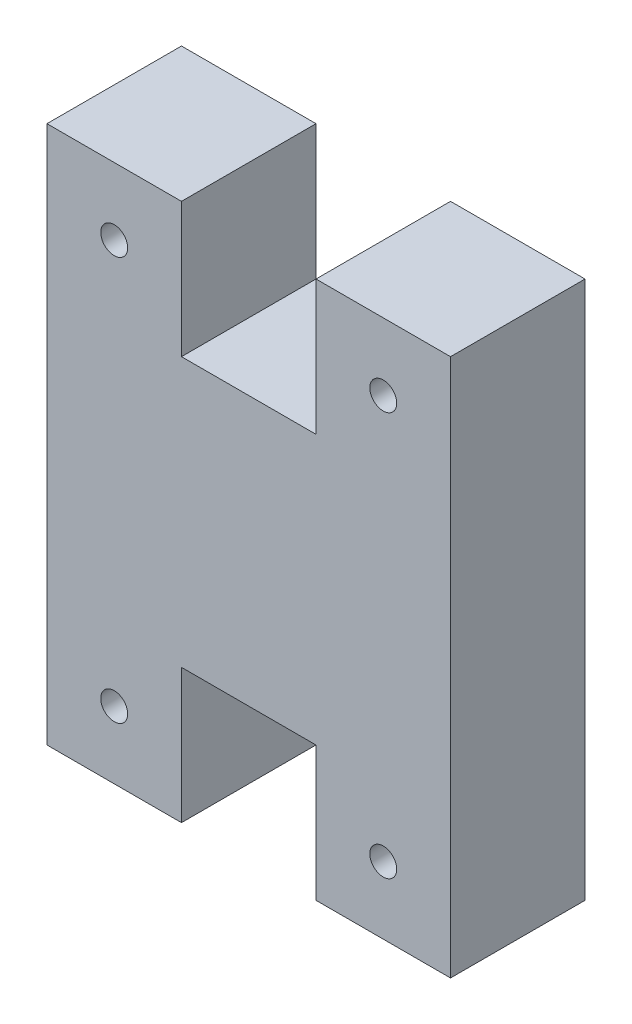
ISO-10303-21;
HEADER;
FILE_DESCRIPTION(('STEP AP214'),'2;1');
FILE_NAME('part.step','',(''),(''),'','','');
FILE_SCHEMA(('AUTOMOTIVE_DESIGN { 1 0 10303 214 1 1 1 1 }'));
ENDSEC;
DATA;
#1=APPLICATION_CONTEXT('core data for automotive mechanical design processes');
#2=APPLICATION_PROTOCOL_DEFINITION('international standard','automotive_design',2000,#1);
#3=PRODUCT_CONTEXT('',#1,'mechanical');
#4=PRODUCT('Part','Part','',(#3));
#5=PRODUCT_RELATED_PRODUCT_CATEGORY('part','',(#4));
#6=PRODUCT_DEFINITION_FORMATION('','',#4);
#7=PRODUCT_DEFINITION_CONTEXT('part definition',#1,'design');
#8=PRODUCT_DEFINITION('design','',#6,#7);
#9=PRODUCT_DEFINITION_SHAPE('','',#8);
#10=(LENGTH_UNIT() NAMED_UNIT(*) SI_UNIT(.MILLI.,.METRE.));
#11=(NAMED_UNIT(*) PLANE_ANGLE_UNIT() SI_UNIT($,.RADIAN.));
#12=(NAMED_UNIT(*) SI_UNIT($,.STERADIAN.) SOLID_ANGLE_UNIT());
#13=UNCERTAINTY_MEASURE_WITH_UNIT(LENGTH_MEASURE(1.E-05),#10,'distance_accuracy_value','');
#14=(GEOMETRIC_REPRESENTATION_CONTEXT(3) GLOBAL_UNCERTAINTY_ASSIGNED_CONTEXT((#13)) GLOBAL_UNIT_ASSIGNED_CONTEXT((#10,
#11,#12)) REPRESENTATION_CONTEXT('',''));
#15=CARTESIAN_POINT('',(0.,0.,0.));
#16=DIRECTION('',(0.,0.,1.));
#17=DIRECTION('',(1.,0.,0.));
#18=AXIS2_PLACEMENT_3D('',#15,#16,#17);
#19=CARTESIAN_POINT('',(0.,0.,6.35));
#20=DIRECTION('',(0.,1.,0.));
#21=DIRECTION('',(0.,0.,1.));
#22=AXIS2_PLACEMENT_3D('',#19,#20,#21);
#23=PLANE('',#22);
#24=DIRECTION('',(0.,0.,1.));
#25=VECTOR('',#24,1.);
#26=CARTESIAN_POINT('',(6.34999999999999,0.,0.));
#27=LINE('',#26,#25);
#28=CARTESIAN_POINT('',(6.34999999999999,0.,0.));
#29=VERTEX_POINT('',#28);
#30=CARTESIAN_POINT('',(6.34999999999999,0.,6.35));
#31=VERTEX_POINT('',#30);
#32=EDGE_CURVE('E232',#29,#31,#27,.T.);
#33=ORIENTED_EDGE('',*,*,#32,.T.);
#34=DIRECTION('',(1.,0.,0.));
#35=VECTOR('',#34,1.);
#36=CARTESIAN_POINT('',(0.,0.,6.35));
#37=LINE('',#36,#35);
#38=CARTESIAN_POINT('',(0.,0.,6.35));
#39=VERTEX_POINT('',#38);
#40=EDGE_CURVE('E189',#39,#31,#37,.T.);
#41=ORIENTED_EDGE('',*,*,#40,.F.);
#42=DIRECTION('',(0.,0.,-1.));
#43=VECTOR('',#42,1.);
#44=CARTESIAN_POINT('',(0.,0.,6.35));
#45=LINE('',#44,#43);
#46=CARTESIAN_POINT('',(0.,0.,0.));
#47=VERTEX_POINT('',#46);
#48=EDGE_CURVE('E13',#39,#47,#45,.T.);
#49=ORIENTED_EDGE('',*,*,#48,.T.);
#50=DIRECTION('',(1.,0.,0.));
#51=VECTOR('',#50,1.);
#52=CARTESIAN_POINT('',(0.,0.,0.));
#53=LINE('',#52,#51);
#54=EDGE_CURVE('E159',#47,#29,#53,.T.);
#55=ORIENTED_EDGE('',*,*,#54,.T.);
#56=EDGE_LOOP('',(#33,#41,#49,#55));
#57=FACE_BOUND('',#56,.T.);
#58=ADVANCED_FACE('F48',(#57),#23,.F.);
#59=DIRECTION('',(0.,0.,1.));
#60=VECTOR('',#59,1.);
#61=CARTESIAN_POINT('',(12.7,0.,0.));
#62=LINE('',#61,#60);
#63=CARTESIAN_POINT('',(12.7,0.,0.));
#64=VERTEX_POINT('',#63);
#65=CARTESIAN_POINT('',(12.7,0.,6.35));
#66=VERTEX_POINT('',#65);
#67=EDGE_CURVE('E138',#64,#66,#62,.T.);
#68=ORIENTED_EDGE('',*,*,#67,.F.);
#69=CARTESIAN_POINT('',(19.05,0.,0.));
#70=VERTEX_POINT('',#69);
#71=EDGE_CURVE('E150',#64,#70,#53,.T.);
#72=ORIENTED_EDGE('',*,*,#71,.T.);
#73=DIRECTION('',(0.,0.,-1.));
#74=VECTOR('',#73,1.);
#75=CARTESIAN_POINT('',(19.05,0.,6.35));
#76=LINE('',#75,#74);
#77=CARTESIAN_POINT('',(19.05,0.,6.35));
#78=VERTEX_POINT('',#77);
#79=EDGE_CURVE('E56',#78,#70,#76,.T.);
#80=ORIENTED_EDGE('',*,*,#79,.F.);
#81=EDGE_CURVE('E152',#66,#78,#37,.T.);
#82=ORIENTED_EDGE('',*,*,#81,.F.);
#83=EDGE_LOOP('',(#68,#72,#80,#82));
#84=FACE_BOUND('',#83,.T.);
#85=ADVANCED_FACE('F148',(#84),#23,.F.);
#86=CARTESIAN_POINT('',(0.,0.,6.35));
#87=DIRECTION('',(0.,0.,-1.));
#88=DIRECTION('',(-1.,0.,0.));
#89=AXIS2_PLACEMENT_3D('',#86,#87,#88);
#90=PLANE('',#89);
#91=CARTESIAN_POINT('',(3.17499999999997,3.17499999999999,6.35));
#92=DIRECTION('',(0.,0.,-1.));
#93=DIRECTION('',(-1.,0.,0.));
#94=AXIS2_PLACEMENT_3D('',#91,#92,#93);
#95=CIRCLE('',#94,0.635);
#96=CARTESIAN_POINT('',(2.53999999999997,3.17499999999999,6.35));
#97=VERTEX_POINT('',#96);
#98=EDGE_CURVE('E284',#97,#97,#95,.T.);
#99=ORIENTED_EDGE('',*,*,#98,.T.);
#100=EDGE_LOOP('',(#99));
#101=FACE_BOUND('',#100,.T.);
#102=CARTESIAN_POINT('',(15.875,3.17499999999999,6.35));
#103=DIRECTION('',(0.,0.,-1.));
#104=DIRECTION('',(-1.,0.,0.));
#105=AXIS2_PLACEMENT_3D('',#102,#103,#104);
#106=CIRCLE('',#105,0.635000000000001);
#107=CARTESIAN_POINT('',(15.24,3.17499999999999,6.35));
#108=VERTEX_POINT('',#107);
#109=EDGE_CURVE('E288',#108,#108,#106,.T.);
#110=ORIENTED_EDGE('',*,*,#109,.T.);
#111=EDGE_LOOP('',(#110));
#112=FACE_BOUND('',#111,.T.);
#113=CARTESIAN_POINT('',(15.875,22.225,6.35));
#114=DIRECTION('',(0.,0.,1.));
#115=DIRECTION('',(1.,0.,0.));
#116=AXIS2_PLACEMENT_3D('',#113,#114,#115);
#117=CIRCLE('',#116,0.634999999999999);
#118=CARTESIAN_POINT('',(16.51,22.225,6.35));
#119=VERTEX_POINT('',#118);
#120=EDGE_CURVE('E292',#119,#119,#117,.T.);
#121=ORIENTED_EDGE('',*,*,#120,.F.);
#122=EDGE_LOOP('',(#121));
#123=FACE_BOUND('',#122,.T.);
#124=CARTESIAN_POINT('',(3.17499999999999,22.225,6.35));
#125=DIRECTION('',(0.,0.,1.));
#126=DIRECTION('',(1.,0.,0.));
#127=AXIS2_PLACEMENT_3D('',#124,#125,#126);
#128=CIRCLE('',#127,0.635);
#129=CARTESIAN_POINT('',(3.80999999999998,22.225,6.35));
#130=VERTEX_POINT('',#129);
#131=EDGE_CURVE('E226',#130,#130,#128,.T.);
#132=ORIENTED_EDGE('',*,*,#131,.F.);
#133=EDGE_LOOP('',(#132));
#134=FACE_BOUND('',#133,.T.);
#135=DIRECTION('',(0.,1.,0.));
#136=VECTOR('',#135,1.);
#137=CARTESIAN_POINT('',(6.34999999999999,0.,6.35));
#138=LINE('',#137,#136);
#139=CARTESIAN_POINT('',(6.35,6.35,6.35));
#140=VERTEX_POINT('',#139);
#141=EDGE_CURVE('E144',#31,#140,#138,.T.);
#142=ORIENTED_EDGE('',*,*,#141,.T.);
#143=DIRECTION('',(1.,0.,0.));
#144=VECTOR('',#143,1.);
#145=CARTESIAN_POINT('',(6.35,6.35,6.35));
#146=LINE('',#145,#144);
#147=CARTESIAN_POINT('',(12.7,6.35,6.35));
#148=VERTEX_POINT('',#147);
#149=EDGE_CURVE('E221',#140,#148,#146,.T.);
#150=ORIENTED_EDGE('',*,*,#149,.T.);
#151=DIRECTION('',(0.,-1.,0.));
#152=VECTOR('',#151,1.);
#153=CARTESIAN_POINT('',(12.7,0.,6.35));
#154=LINE('',#153,#152);
#155=EDGE_CURVE('E219',#148,#66,#154,.T.);
#156=ORIENTED_EDGE('',*,*,#155,.T.);
#157=ORIENTED_EDGE('',*,*,#81,.T.);
#158=DIRECTION('',(0.,1.,0.));
#159=VECTOR('',#158,1.);
#160=CARTESIAN_POINT('',(19.05,0.,6.35));
#161=LINE('',#160,#159);
#162=CARTESIAN_POINT('',(19.05,25.4,6.35));
#163=VERTEX_POINT('',#162);
#164=EDGE_CURVE('E184',#78,#163,#161,.T.);
#165=ORIENTED_EDGE('',*,*,#164,.T.);
#166=DIRECTION('',(-1.,0.,0.));
#167=VECTOR('',#166,1.);
#168=CARTESIAN_POINT('',(0.,25.4,6.35));
#169=LINE('',#168,#167);
#170=CARTESIAN_POINT('',(12.7,25.4,6.35));
#171=VERTEX_POINT('',#170);
#172=EDGE_CURVE('E178',#163,#171,#169,.T.);
#173=ORIENTED_EDGE('',*,*,#172,.T.);
#174=DIRECTION('',(0.,1.,0.));
#175=VECTOR('',#174,1.);
#176=CARTESIAN_POINT('',(12.7,25.4,6.35));
#177=LINE('',#176,#175);
#178=CARTESIAN_POINT('',(12.7,19.05,6.35));
#179=VERTEX_POINT('',#178);
#180=EDGE_CURVE('E198',#179,#171,#177,.T.);
#181=ORIENTED_EDGE('',*,*,#180,.F.);
#182=DIRECTION('',(1.,0.,0.));
#183=VECTOR('',#182,1.);
#184=CARTESIAN_POINT('',(6.35,19.05,6.35));
#185=LINE('',#184,#183);
#186=CARTESIAN_POINT('',(6.35,19.05,6.35));
#187=VERTEX_POINT('',#186);
#188=EDGE_CURVE('E245',#187,#179,#185,.T.);
#189=ORIENTED_EDGE('',*,*,#188,.F.);
#190=DIRECTION('',(0.,-1.,0.));
#191=VECTOR('',#190,1.);
#192=CARTESIAN_POINT('',(6.34999999999999,25.4,6.35));
#193=LINE('',#192,#191);
#194=CARTESIAN_POINT('',(6.34999999999999,25.4,6.35));
#195=VERTEX_POINT('',#194);
#196=EDGE_CURVE('E235',#195,#187,#193,.T.);
#197=ORIENTED_EDGE('',*,*,#196,.F.);
#198=CARTESIAN_POINT('',(0.,25.4,6.35));
#199=VERTEX_POINT('',#198);
#200=EDGE_CURVE('E188',#195,#199,#169,.T.);
#201=ORIENTED_EDGE('',*,*,#200,.T.);
#202=DIRECTION('',(0.,-1.,0.));
#203=VECTOR('',#202,1.);
#204=CARTESIAN_POINT('',(0.,0.,6.35));
#205=LINE('',#204,#203);
#206=EDGE_CURVE('E173',#199,#39,#205,.T.);
#207=ORIENTED_EDGE('',*,*,#206,.T.);
#208=ORIENTED_EDGE('',*,*,#40,.T.);
#209=EDGE_LOOP('',(#142,#150,#156,#157,#165,#173,#181,#189,#197,#201,#207,#208));
#210=FACE_BOUND('',#209,.T.);
#211=ADVANCED_FACE('F196',(#101,#112,#123,#134,#210),#90,.F.);
#212=CARTESIAN_POINT('',(0.,0.,0.));
#213=DIRECTION('',(0.,0.,-1.));
#214=DIRECTION('',(-1.,0.,0.));
#215=AXIS2_PLACEMENT_3D('',#212,#213,#214);
#216=PLANE('',#215);
#217=CARTESIAN_POINT('',(3.17499999999997,3.17499999999999,0.));
#218=DIRECTION('',(0.,0.,-1.));
#219=DIRECTION('',(-1.,0.,0.));
#220=AXIS2_PLACEMENT_3D('',#217,#218,#219);
#221=CIRCLE('',#220,0.635);
#222=CARTESIAN_POINT('',(2.53999999999997,3.17499999999999,0.));
#223=VERTEX_POINT('',#222);
#224=EDGE_CURVE('E431',#223,#223,#221,.T.);
#225=ORIENTED_EDGE('',*,*,#224,.F.);
#226=EDGE_LOOP('',(#225));
#227=FACE_BOUND('',#226,.T.);
#228=CARTESIAN_POINT('',(15.875,3.17499999999999,0.));
#229=DIRECTION('',(0.,0.,-1.));
#230=DIRECTION('',(-1.,0.,0.));
#231=AXIS2_PLACEMENT_3D('',#228,#229,#230);
#232=CIRCLE('',#231,0.635000000000001);
#233=CARTESIAN_POINT('',(15.24,3.17499999999999,0.));
#234=VERTEX_POINT('',#233);
#235=EDGE_CURVE('E433',#234,#234,#232,.T.);
#236=ORIENTED_EDGE('',*,*,#235,.F.);
#237=EDGE_LOOP('',(#236));
#238=FACE_BOUND('',#237,.T.);
#239=CARTESIAN_POINT('',(15.875,22.225,0.));
#240=DIRECTION('',(0.,0.,1.));
#241=DIRECTION('',(1.,0.,0.));
#242=AXIS2_PLACEMENT_3D('',#239,#240,#241);
#243=CIRCLE('',#242,0.634999999999999);
#244=CARTESIAN_POINT('',(16.51,22.225,0.));
#245=VERTEX_POINT('',#244);
#246=EDGE_CURVE('E296',#245,#245,#243,.T.);
#247=ORIENTED_EDGE('',*,*,#246,.T.);
#248=EDGE_LOOP('',(#247));
#249=FACE_BOUND('',#248,.T.);
#250=CARTESIAN_POINT('',(3.17499999999999,22.225,0.));
#251=DIRECTION('',(0.,0.,1.));
#252=DIRECTION('',(1.,0.,0.));
#253=AXIS2_PLACEMENT_3D('',#250,#251,#252);
#254=CIRCLE('',#253,0.635);
#255=CARTESIAN_POINT('',(3.80999999999998,22.225,0.));
#256=VERTEX_POINT('',#255);
#257=EDGE_CURVE('E222',#256,#256,#254,.T.);
#258=ORIENTED_EDGE('',*,*,#257,.T.);
#259=EDGE_LOOP('',(#258));
#260=FACE_BOUND('',#259,.T.);
#261=DIRECTION('',(1.,0.,0.));
#262=VECTOR('',#261,1.);
#263=CARTESIAN_POINT('',(6.35,6.35,0.));
#264=LINE('',#263,#262);
#265=CARTESIAN_POINT('',(6.35,6.35,0.));
#266=VERTEX_POINT('',#265);
#267=CARTESIAN_POINT('',(12.7,6.35,0.));
#268=VERTEX_POINT('',#267);
#269=EDGE_CURVE('E143',#266,#268,#264,.T.);
#270=ORIENTED_EDGE('',*,*,#269,.F.);
#271=DIRECTION('',(0.,1.,0.));
#272=VECTOR('',#271,1.);
#273=CARTESIAN_POINT('',(6.34999999999999,0.,0.));
#274=LINE('',#273,#272);
#275=EDGE_CURVE('E153',#29,#266,#274,.T.);
#276=ORIENTED_EDGE('',*,*,#275,.F.);
#277=ORIENTED_EDGE('',*,*,#54,.F.);
#278=DIRECTION('',(0.,-1.,0.));
#279=VECTOR('',#278,1.);
#280=CARTESIAN_POINT('',(0.,0.,0.));
#281=LINE('',#280,#279);
#282=CARTESIAN_POINT('',(0.,25.4,0.));
#283=VERTEX_POINT('',#282);
#284=EDGE_CURVE('E160',#283,#47,#281,.T.);
#285=ORIENTED_EDGE('',*,*,#284,.F.);
#286=DIRECTION('',(-1.,0.,0.));
#287=VECTOR('',#286,1.);
#288=CARTESIAN_POINT('',(0.,25.4,0.));
#289=LINE('',#288,#287);
#290=CARTESIAN_POINT('',(6.34999999999999,25.4,0.));
#291=VERTEX_POINT('',#290);
#292=EDGE_CURVE('E169',#291,#283,#289,.T.);
#293=ORIENTED_EDGE('',*,*,#292,.F.);
#294=DIRECTION('',(0.,-1.,0.));
#295=VECTOR('',#294,1.);
#296=CARTESIAN_POINT('',(6.34999999999999,25.4,0.));
#297=LINE('',#296,#295);
#298=CARTESIAN_POINT('',(6.35,19.05,0.));
#299=VERTEX_POINT('',#298);
#300=EDGE_CURVE('E239',#291,#299,#297,.T.);
#301=ORIENTED_EDGE('',*,*,#300,.T.);
#302=DIRECTION('',(1.,0.,0.));
#303=VECTOR('',#302,1.);
#304=CARTESIAN_POINT('',(6.35,19.05,0.));
#305=LINE('',#304,#303);
#306=CARTESIAN_POINT('',(12.7,19.05,0.));
#307=VERTEX_POINT('',#306);
#308=EDGE_CURVE('E71',#299,#307,#305,.T.);
#309=ORIENTED_EDGE('',*,*,#308,.T.);
#310=DIRECTION('',(0.,1.,0.));
#311=VECTOR('',#310,1.);
#312=CARTESIAN_POINT('',(12.7,25.4,0.));
#313=LINE('',#312,#311);
#314=CARTESIAN_POINT('',(12.7,25.4,0.));
#315=VERTEX_POINT('',#314);
#316=EDGE_CURVE('E214',#307,#315,#313,.T.);
#317=ORIENTED_EDGE('',*,*,#316,.T.);
#318=CARTESIAN_POINT('',(19.05,25.4,0.));
#319=VERTEX_POINT('',#318);
#320=EDGE_CURVE('E170',#319,#315,#289,.T.);
#321=ORIENTED_EDGE('',*,*,#320,.F.);
#322=DIRECTION('',(0.,1.,0.));
#323=VECTOR('',#322,1.);
#324=CARTESIAN_POINT('',(19.05,0.,0.));
#325=LINE('',#324,#323);
#326=EDGE_CURVE('E158',#70,#319,#325,.T.);
#327=ORIENTED_EDGE('',*,*,#326,.F.);
#328=ORIENTED_EDGE('',*,*,#71,.F.);
#329=DIRECTION('',(0.,-1.,0.));
#330=VECTOR('',#329,1.);
#331=CARTESIAN_POINT('',(12.7,0.,0.));
#332=LINE('',#331,#330);
#333=EDGE_CURVE('E135',#268,#64,#332,.T.);
#334=ORIENTED_EDGE('',*,*,#333,.F.);
#335=EDGE_LOOP('',(#270,#276,#277,#285,#293,#301,#309,#317,#321,#327,#328,#334));
#336=FACE_BOUND('',#335,.T.);
#337=ADVANCED_FACE('F156',(#227,#238,#249,#260,#336),#216,.T.);
#338=CARTESIAN_POINT('',(0.,25.4,6.35));
#339=DIRECTION('',(0.,-1.,0.));
#340=DIRECTION('',(0.,0.,-1.));
#341=AXIS2_PLACEMENT_3D('',#338,#339,#340);
#342=PLANE('',#341);
#343=ORIENTED_EDGE('',*,*,#320,.T.);
#344=DIRECTION('',(0.,0.,1.));
#345=VECTOR('',#344,1.);
#346=CARTESIAN_POINT('',(12.7,25.4,0.));
#347=LINE('',#346,#345);
#348=EDGE_CURVE('E164',#315,#171,#347,.T.);
#349=ORIENTED_EDGE('',*,*,#348,.T.);
#350=ORIENTED_EDGE('',*,*,#172,.F.);
#351=DIRECTION('',(0.,0.,-1.));
#352=VECTOR('',#351,1.);
#353=CARTESIAN_POINT('',(19.05,25.4,6.35));
#354=LINE('',#353,#352);
#355=EDGE_CURVE('E177',#163,#319,#354,.T.);
#356=ORIENTED_EDGE('',*,*,#355,.T.);
#357=EDGE_LOOP('',(#343,#349,#350,#356));
#358=FACE_BOUND('',#357,.T.);
#359=ADVANCED_FACE('F201',(#358),#342,.F.);
#360=CARTESIAN_POINT('',(0.,0.,6.35));
#361=DIRECTION('',(1.,0.,0.));
#362=DIRECTION('',(0.,1.,0.));
#363=AXIS2_PLACEMENT_3D('',#360,#361,#362);
#364=PLANE('',#363);
#365=ORIENTED_EDGE('',*,*,#284,.T.);
#366=ORIENTED_EDGE('',*,*,#48,.F.);
#367=ORIENTED_EDGE('',*,*,#206,.F.);
#368=DIRECTION('',(0.,0.,-1.));
#369=VECTOR('',#368,1.);
#370=CARTESIAN_POINT('',(0.,25.4,6.35));
#371=LINE('',#370,#369);
#372=EDGE_CURVE('E174',#199,#283,#371,.T.);
#373=ORIENTED_EDGE('',*,*,#372,.T.);
#374=EDGE_LOOP('',(#365,#366,#367,#373));
#375=FACE_BOUND('',#374,.T.);
#376=ADVANCED_FACE('F50',(#375),#364,.F.);
#377=CARTESIAN_POINT('',(19.05,0.,6.35));
#378=DIRECTION('',(-1.,0.,0.));
#379=DIRECTION('',(0.,-1.,0.));
#380=AXIS2_PLACEMENT_3D('',#377,#378,#379);
#381=PLANE('',#380);
#382=ORIENTED_EDGE('',*,*,#326,.T.);
#383=ORIENTED_EDGE('',*,*,#355,.F.);
#384=ORIENTED_EDGE('',*,*,#164,.F.);
#385=ORIENTED_EDGE('',*,*,#79,.T.);
#386=EDGE_LOOP('',(#382,#383,#384,#385));
#387=FACE_BOUND('',#386,.T.);
#388=ADVANCED_FACE('F182',(#387),#381,.F.);
#389=ORIENTED_EDGE('',*,*,#200,.F.);
#390=DIRECTION('',(0.,0.,1.));
#391=VECTOR('',#390,1.);
#392=CARTESIAN_POINT('',(6.34999999999999,25.4,0.));
#393=LINE('',#392,#391);
#394=EDGE_CURVE('E213',#291,#195,#393,.T.);
#395=ORIENTED_EDGE('',*,*,#394,.F.);
#396=ORIENTED_EDGE('',*,*,#292,.T.);
#397=ORIENTED_EDGE('',*,*,#372,.F.);
#398=EDGE_LOOP('',(#389,#395,#396,#397));
#399=FACE_BOUND('',#398,.T.);
#400=ADVANCED_FACE('F259',(#399),#342,.F.);
#401=CARTESIAN_POINT('',(12.7,25.4,0.));
#402=DIRECTION('',(1.,0.,0.));
#403=DIRECTION('',(0.,1.,0.));
#404=AXIS2_PLACEMENT_3D('',#401,#402,#403);
#405=PLANE('',#404);
#406=ORIENTED_EDGE('',*,*,#180,.T.);
#407=ORIENTED_EDGE('',*,*,#348,.F.);
#408=ORIENTED_EDGE('',*,*,#316,.F.);
#409=DIRECTION('',(0.,0.,1.));
#410=VECTOR('',#409,1.);
#411=CARTESIAN_POINT('',(12.7,19.05,0.));
#412=LINE('',#411,#410);
#413=EDGE_CURVE('E205',#307,#179,#412,.T.);
#414=ORIENTED_EDGE('',*,*,#413,.T.);
#415=EDGE_LOOP('',(#406,#407,#408,#414));
#416=FACE_BOUND('',#415,.T.);
#417=ADVANCED_FACE('F247',(#416),#405,.F.);
#418=CARTESIAN_POINT('',(6.35,19.05,0.));
#419=DIRECTION('',(0.,-1.,0.));
#420=DIRECTION('',(0.,0.,-1.));
#421=AXIS2_PLACEMENT_3D('',#418,#419,#420);
#422=PLANE('',#421);
#423=ORIENTED_EDGE('',*,*,#188,.T.);
#424=ORIENTED_EDGE('',*,*,#413,.F.);
#425=ORIENTED_EDGE('',*,*,#308,.F.);
#426=DIRECTION('',(0.,0.,1.));
#427=VECTOR('',#426,1.);
#428=CARTESIAN_POINT('',(6.35,19.05,0.));
#429=LINE('',#428,#427);
#430=EDGE_CURVE('E207',#299,#187,#429,.T.);
#431=ORIENTED_EDGE('',*,*,#430,.T.);
#432=EDGE_LOOP('',(#423,#424,#425,#431));
#433=FACE_BOUND('',#432,.T.);
#434=ADVANCED_FACE('F248',(#433),#422,.F.);
#435=CARTESIAN_POINT('',(6.34999999999999,25.4,0.));
#436=DIRECTION('',(-1.,0.,0.));
#437=DIRECTION('',(0.,-1.,0.));
#438=AXIS2_PLACEMENT_3D('',#435,#436,#437);
#439=PLANE('',#438);
#440=ORIENTED_EDGE('',*,*,#196,.T.);
#441=ORIENTED_EDGE('',*,*,#430,.F.);
#442=ORIENTED_EDGE('',*,*,#300,.F.);
#443=ORIENTED_EDGE('',*,*,#394,.T.);
#444=EDGE_LOOP('',(#440,#441,#442,#443));
#445=FACE_BOUND('',#444,.T.);
#446=ADVANCED_FACE('F250',(#445),#439,.F.);
#447=CARTESIAN_POINT('',(6.34999999999999,0.,0.));
#448=DIRECTION('',(1.,0.,0.));
#449=DIRECTION('',(0.,1.,0.));
#450=AXIS2_PLACEMENT_3D('',#447,#448,#449);
#451=PLANE('',#450);
#452=ORIENTED_EDGE('',*,*,#141,.F.);
#453=ORIENTED_EDGE('',*,*,#32,.F.);
#454=ORIENTED_EDGE('',*,*,#275,.T.);
#455=DIRECTION('',(0.,0.,1.));
#456=VECTOR('',#455,1.);
#457=CARTESIAN_POINT('',(6.35,6.35,0.));
#458=LINE('',#457,#456);
#459=EDGE_CURVE('E236',#266,#140,#458,.T.);
#460=ORIENTED_EDGE('',*,*,#459,.T.);
#461=EDGE_LOOP('',(#452,#453,#454,#460));
#462=FACE_BOUND('',#461,.T.);
#463=ADVANCED_FACE('F256',(#462),#451,.T.);
#464=CARTESIAN_POINT('',(6.35,6.35,0.));
#465=DIRECTION('',(0.,-1.,0.));
#466=DIRECTION('',(0.,0.,-1.));
#467=AXIS2_PLACEMENT_3D('',#464,#465,#466);
#468=PLANE('',#467);
#469=ORIENTED_EDGE('',*,*,#149,.F.);
#470=ORIENTED_EDGE('',*,*,#459,.F.);
#471=ORIENTED_EDGE('',*,*,#269,.T.);
#472=DIRECTION('',(0.,0.,1.));
#473=VECTOR('',#472,1.);
#474=CARTESIAN_POINT('',(12.7,6.35,0.));
#475=LINE('',#474,#473);
#476=EDGE_CURVE('E63',#268,#148,#475,.T.);
#477=ORIENTED_EDGE('',*,*,#476,.T.);
#478=EDGE_LOOP('',(#469,#470,#471,#477));
#479=FACE_BOUND('',#478,.T.);
#480=ADVANCED_FACE('F305',(#479),#468,.T.);
#481=CARTESIAN_POINT('',(12.7,0.,0.));
#482=DIRECTION('',(-1.,0.,0.));
#483=DIRECTION('',(0.,-1.,0.));
#484=AXIS2_PLACEMENT_3D('',#481,#482,#483);
#485=PLANE('',#484);
#486=ORIENTED_EDGE('',*,*,#155,.F.);
#487=ORIENTED_EDGE('',*,*,#476,.F.);
#488=ORIENTED_EDGE('',*,*,#333,.T.);
#489=ORIENTED_EDGE('',*,*,#67,.T.);
#490=EDGE_LOOP('',(#486,#487,#488,#489));
#491=FACE_BOUND('',#490,.T.);
#492=ADVANCED_FACE('F137',(#491),#485,.T.);
#493=CARTESIAN_POINT('',(3.17499999999999,22.225,0.));
#494=DIRECTION('',(0.,0.,1.));
#495=DIRECTION('',(1.,0.,0.));
#496=AXIS2_PLACEMENT_3D('',#493,#494,#495);
#497=CYLINDRICAL_SURFACE('',#496,0.635);
#498=ORIENTED_EDGE('',*,*,#257,.F.);
#499=EDGE_LOOP('',(#498));
#500=FACE_BOUND('',#499,.T.);
#501=ORIENTED_EDGE('',*,*,#131,.T.);
#502=EDGE_LOOP('',(#501));
#503=FACE_BOUND('',#502,.T.);
#504=ADVANCED_FACE('F362',(#500,#503),#497,.F.);
#505=CARTESIAN_POINT('',(15.875,22.225,0.));
#506=DIRECTION('',(0.,0.,1.));
#507=DIRECTION('',(1.,0.,0.));
#508=AXIS2_PLACEMENT_3D('',#505,#506,#507);
#509=CYLINDRICAL_SURFACE('',#508,0.634999999999999);
#510=ORIENTED_EDGE('',*,*,#246,.F.);
#511=EDGE_LOOP('',(#510));
#512=FACE_BOUND('',#511,.T.);
#513=ORIENTED_EDGE('',*,*,#120,.T.);
#514=EDGE_LOOP('',(#513));
#515=FACE_BOUND('',#514,.T.);
#516=ADVANCED_FACE('F369',(#512,#515),#509,.F.);
#517=CARTESIAN_POINT('',(15.875,3.17499999999999,6.35));
#518=DIRECTION('',(0.,0.,-1.));
#519=DIRECTION('',(-1.,0.,0.));
#520=AXIS2_PLACEMENT_3D('',#517,#518,#519);
#521=CYLINDRICAL_SURFACE('',#520,0.635000000000001);
#522=ORIENTED_EDGE('',*,*,#109,.F.);
#523=EDGE_LOOP('',(#522));
#524=FACE_BOUND('',#523,.T.);
#525=ORIENTED_EDGE('',*,*,#235,.T.);
#526=EDGE_LOOP('',(#525));
#527=FACE_BOUND('',#526,.T.);
#528=ADVANCED_FACE('F376',(#524,#527),#521,.F.);
#529=CARTESIAN_POINT('',(3.17499999999997,3.17499999999999,6.35));
#530=DIRECTION('',(0.,0.,-1.));
#531=DIRECTION('',(-1.,0.,0.));
#532=AXIS2_PLACEMENT_3D('',#529,#530,#531);
#533=CYLINDRICAL_SURFACE('',#532,0.635);
#534=ORIENTED_EDGE('',*,*,#98,.F.);
#535=EDGE_LOOP('',(#534));
#536=FACE_BOUND('',#535,.T.);
#537=ORIENTED_EDGE('',*,*,#224,.T.);
#538=EDGE_LOOP('',(#537));
#539=FACE_BOUND('',#538,.T.);
#540=ADVANCED_FACE('F384',(#536,#539),#533,.F.);
#541=CLOSED_SHELL('',(#58,#85,#211,#337,#359,#376,#388,#400,#417,#434,#446,#463,#480,#492,#504,
#516,#528,#540));
#542=MANIFOLD_SOLID_BREP('B2',#541);
#543=ADVANCED_BREP_SHAPE_REPRESENTATION('',(#18,#542),#14);
#544=SHAPE_DEFINITION_REPRESENTATION(#9,#543);
ENDSEC;
END-ISO-10303-21;
